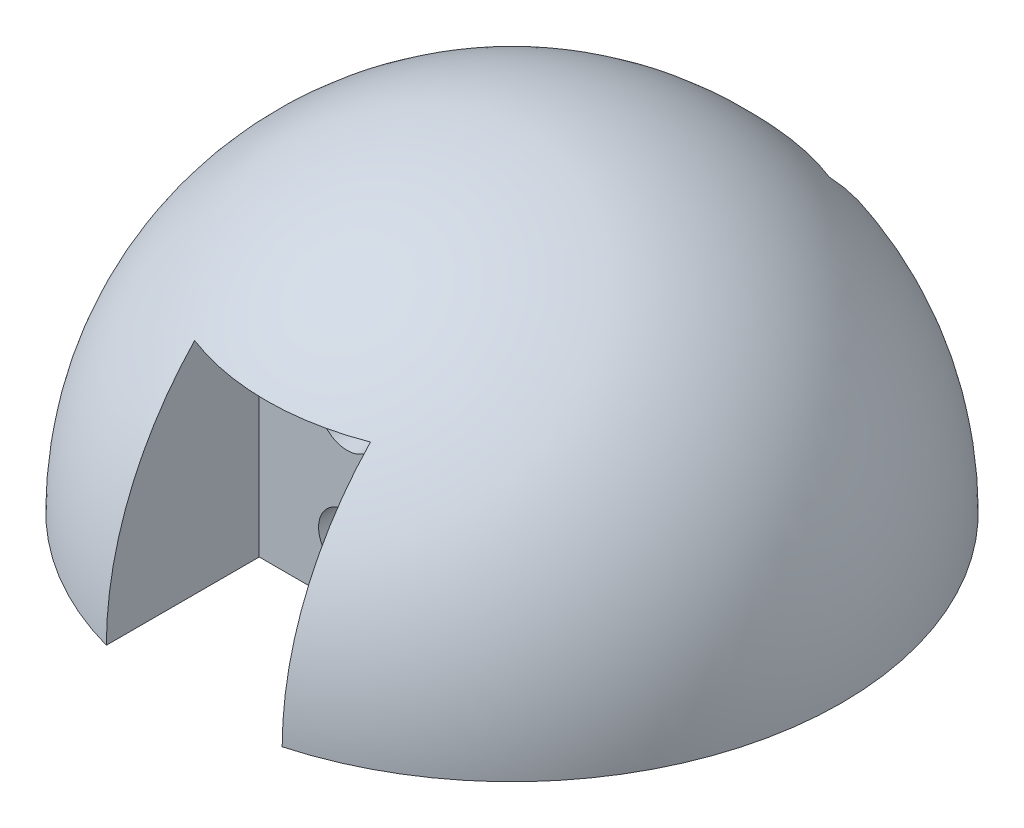
ISO-10303-21;
HEADER;
FILE_DESCRIPTION(('STEP AP214'),'2;1');
FILE_NAME('part.step','',(''),(''),'','','');
FILE_SCHEMA(('AUTOMOTIVE_DESIGN { 1 0 10303 214 1 1 1 1 }'));
ENDSEC;
DATA;
#1=APPLICATION_CONTEXT('core data for automotive mechanical design processes');
#2=APPLICATION_PROTOCOL_DEFINITION('international standard','automotive_design',2000,#1);
#3=PRODUCT_CONTEXT('',#1,'mechanical');
#4=PRODUCT('Part','Part','',(#3));
#5=PRODUCT_RELATED_PRODUCT_CATEGORY('part','',(#4));
#6=PRODUCT_DEFINITION_FORMATION('','',#4);
#7=PRODUCT_DEFINITION_CONTEXT('part definition',#1,'design');
#8=PRODUCT_DEFINITION('design','',#6,#7);
#9=PRODUCT_DEFINITION_SHAPE('','',#8);
#10=(LENGTH_UNIT() NAMED_UNIT(*) SI_UNIT(.MILLI.,.METRE.));
#11=(NAMED_UNIT(*) PLANE_ANGLE_UNIT() SI_UNIT($,.RADIAN.));
#12=(NAMED_UNIT(*) SI_UNIT($,.STERADIAN.) SOLID_ANGLE_UNIT());
#13=UNCERTAINTY_MEASURE_WITH_UNIT(LENGTH_MEASURE(1.E-05),#10,'distance_accuracy_value','');
#14=(GEOMETRIC_REPRESENTATION_CONTEXT(3) GLOBAL_UNCERTAINTY_ASSIGNED_CONTEXT((#13)) GLOBAL_UNIT_ASSIGNED_CONTEXT((#10,
#11,#12)) REPRESENTATION_CONTEXT('',''));
#15=CARTESIAN_POINT('',(0.,0.,0.));
#16=DIRECTION('',(0.,0.,1.));
#17=DIRECTION('',(1.,0.,0.));
#18=AXIS2_PLACEMENT_3D('',#15,#16,#17);
#19=CARTESIAN_POINT('',(0.,0.,0.));
#20=DIRECTION('',(0.,-1.,0.));
#21=DIRECTION('',(-1.,0.,0.));
#22=AXIS2_PLACEMENT_3D('',#19,#20,#21);
#23=SPHERICAL_SURFACE('',#22,30.);
#24=CARTESIAN_POINT('',(0.,0.,0.));
#25=DIRECTION('',(0.,-1.,0.));
#26=DIRECTION('',(0.,0.,-1.));
#27=AXIS2_PLACEMENT_3D('',#24,#25,#26);
#28=CIRCLE('',#27,30.);
#29=CARTESIAN_POINT('',(-8.,0.,28.9136645896019));
#30=VERTEX_POINT('',#29);
#31=CARTESIAN_POINT('',(-8.,0.,-28.9136645896019));
#32=VERTEX_POINT('',#31);
#33=EDGE_CURVE('E285',#30,#32,#28,.T.);
#34=ORIENTED_EDGE('',*,*,#33,.F.);
#35=CARTESIAN_POINT('',(-8.,0.,0.));
#36=DIRECTION('',(-1.,0.,0.));
#37=DIRECTION('',(0.,0.,1.));
#38=AXIS2_PLACEMENT_3D('',#35,#36,#37);
#39=CIRCLE('',#38,28.9136645896019);
#40=CARTESIAN_POINT('',(-8.,20.,20.8806130178211));
#41=VERTEX_POINT('',#40);
#42=EDGE_CURVE('E191',#30,#41,#39,.T.);
#43=ORIENTED_EDGE('',*,*,#42,.T.);
#44=CARTESIAN_POINT('',(0.,20.,0.));
#45=DIRECTION('',(0.,1.,0.));
#46=DIRECTION('',(0.,0.,1.));
#47=AXIS2_PLACEMENT_3D('',#44,#45,#46);
#48=CIRCLE('',#47,22.3606797749979);
#49=CARTESIAN_POINT('',(8.,20.,20.8806130178211));
#50=VERTEX_POINT('',#49);
#51=EDGE_CURVE('E13',#41,#50,#48,.T.);
#52=ORIENTED_EDGE('',*,*,#51,.T.);
#53=CARTESIAN_POINT('',(8.,0.,0.));
#54=DIRECTION('',(1.,0.,0.));
#55=DIRECTION('',(0.,0.,-1.));
#56=AXIS2_PLACEMENT_3D('',#53,#54,#55);
#57=CIRCLE('',#56,28.9136645896019);
#58=CARTESIAN_POINT('',(8.,0.,28.9136645896019));
#59=VERTEX_POINT('',#58);
#60=EDGE_CURVE('E187',#50,#59,#57,.T.);
#61=ORIENTED_EDGE('',*,*,#60,.T.);
#62=CARTESIAN_POINT('',(8.,0.,-28.9136645896019));
#63=VERTEX_POINT('',#62);
#64=EDGE_CURVE('E172',#63,#59,#28,.T.);
#65=ORIENTED_EDGE('',*,*,#64,.F.);
#66=CARTESIAN_POINT('',(8.,0.,0.));
#67=DIRECTION('',(-1.,0.,0.));
#68=DIRECTION('',(0.,0.,1.));
#69=AXIS2_PLACEMENT_3D('',#66,#67,#68);
#70=CIRCLE('',#69,28.9136645896019);
#71=CARTESIAN_POINT('',(8.,20.,-20.8806130178211));
#72=VERTEX_POINT('',#71);
#73=EDGE_CURVE('E228',#72,#63,#70,.T.);
#74=ORIENTED_EDGE('',*,*,#73,.F.);
#75=CARTESIAN_POINT('',(0.,20.,0.));
#76=DIRECTION('',(0.,-1.,0.));
#77=DIRECTION('',(0.,0.,-1.));
#78=AXIS2_PLACEMENT_3D('',#75,#76,#77);
#79=CIRCLE('',#78,22.3606797749979);
#80=CARTESIAN_POINT('',(-8.,20.,-20.8806130178211));
#81=VERTEX_POINT('',#80);
#82=EDGE_CURVE('E66',#81,#72,#79,.T.);
#83=ORIENTED_EDGE('',*,*,#82,.F.);
#84=CARTESIAN_POINT('',(-8.,0.,0.));
#85=DIRECTION('',(1.,0.,0.));
#86=DIRECTION('',(0.,0.,-1.));
#87=AXIS2_PLACEMENT_3D('',#84,#85,#86);
#88=CIRCLE('',#87,28.9136645896019);
#89=EDGE_CURVE('E231',#32,#81,#88,.T.);
#90=ORIENTED_EDGE('',*,*,#89,.F.);
#91=EDGE_LOOP('',(#34,#43,#52,#61,#65,#74,#83,#90));
#92=FACE_BOUND('',#91,.T.);
#93=ADVANCED_FACE('F58',(#92),#23,.T.);
#94=CARTESIAN_POINT('',(0.,0.,0.));
#95=DIRECTION('',(0.,-1.,0.));
#96=DIRECTION('',(0.,0.,-1.));
#97=AXIS2_PLACEMENT_3D('',#94,#95,#96);
#98=PLANE('',#97);
#99=DIRECTION('',(0.,0.,1.));
#100=VECTOR('',#99,1.);
#101=CARTESIAN_POINT('',(-8.,0.,15.));
#102=LINE('',#101,#100);
#103=CARTESIAN_POINT('',(-8.,0.,15.));
#104=VERTEX_POINT('',#103);
#105=EDGE_CURVE('E174',#104,#30,#102,.T.);
#106=ORIENTED_EDGE('',*,*,#105,.T.);
#107=ORIENTED_EDGE('',*,*,#33,.T.);
#108=DIRECTION('',(0.,0.,-1.));
#109=VECTOR('',#108,1.);
#110=CARTESIAN_POINT('',(-8.,0.,-15.));
#111=LINE('',#110,#109);
#112=CARTESIAN_POINT('',(-8.,0.,-15.));
#113=VERTEX_POINT('',#112);
#114=EDGE_CURVE('E219',#113,#32,#111,.T.);
#115=ORIENTED_EDGE('',*,*,#114,.F.);
#116=DIRECTION('',(1.,0.,0.));
#117=VECTOR('',#116,1.);
#118=CARTESIAN_POINT('',(-8.,0.,-15.));
#119=LINE('',#118,#117);
#120=CARTESIAN_POINT('',(8.,0.,-15.));
#121=VERTEX_POINT('',#120);
#122=EDGE_CURVE('E199',#113,#121,#119,.T.);
#123=ORIENTED_EDGE('',*,*,#122,.T.);
#124=DIRECTION('',(0.,0.,-1.));
#125=VECTOR('',#124,1.);
#126=CARTESIAN_POINT('',(8.,0.,-15.));
#127=LINE('',#126,#125);
#128=EDGE_CURVE('E216',#121,#63,#127,.T.);
#129=ORIENTED_EDGE('',*,*,#128,.T.);
#130=ORIENTED_EDGE('',*,*,#64,.T.);
#131=DIRECTION('',(0.,0.,1.));
#132=VECTOR('',#131,1.);
#133=CARTESIAN_POINT('',(8.,0.,15.));
#134=LINE('',#133,#132);
#135=CARTESIAN_POINT('',(8.,0.,15.));
#136=VERTEX_POINT('',#135);
#137=EDGE_CURVE('E151',#136,#59,#134,.T.);
#138=ORIENTED_EDGE('',*,*,#137,.F.);
#139=DIRECTION('',(1.,0.,0.));
#140=VECTOR('',#139,1.);
#141=CARTESIAN_POINT('',(-8.,0.,15.));
#142=LINE('',#141,#140);
#143=EDGE_CURVE('E158',#104,#136,#142,.T.);
#144=ORIENTED_EDGE('',*,*,#143,.F.);
#145=EDGE_LOOP('',(#106,#107,#115,#123,#129,#130,#138,#144));
#146=FACE_BOUND('',#145,.T.);
#147=DIRECTION('',(0.,0.,-1.));
#148=VECTOR('',#147,1.);
#149=CARTESIAN_POINT('',(-10.,0.,5.));
#150=LINE('',#149,#148);
#151=CARTESIAN_POINT('',(-10.,0.,5.));
#152=VERTEX_POINT('',#151);
#153=CARTESIAN_POINT('',(-10.,0.,-5.));
#154=VERTEX_POINT('',#153);
#155=EDGE_CURVE('E247',#152,#154,#150,.T.);
#156=ORIENTED_EDGE('',*,*,#155,.F.);
#157=DIRECTION('',(-1.,0.,0.));
#158=VECTOR('',#157,1.);
#159=CARTESIAN_POINT('',(-10.,0.,5.));
#160=LINE('',#159,#158);
#161=CARTESIAN_POINT('',(10.,0.,5.));
#162=VERTEX_POINT('',#161);
#163=EDGE_CURVE('E256',#162,#152,#160,.T.);
#164=ORIENTED_EDGE('',*,*,#163,.F.);
#165=DIRECTION('',(0.,0.,1.));
#166=VECTOR('',#165,1.);
#167=CARTESIAN_POINT('',(10.,0.,5.));
#168=LINE('',#167,#166);
#169=CARTESIAN_POINT('',(10.,0.,-5.));
#170=VERTEX_POINT('',#169);
#171=EDGE_CURVE('E275',#170,#162,#168,.T.);
#172=ORIENTED_EDGE('',*,*,#171,.F.);
#173=DIRECTION('',(1.,0.,0.));
#174=VECTOR('',#173,1.);
#175=CARTESIAN_POINT('',(-10.,0.,-5.));
#176=LINE('',#175,#174);
#177=EDGE_CURVE('E271',#154,#170,#176,.T.);
#178=ORIENTED_EDGE('',*,*,#177,.F.);
#179=EDGE_LOOP('',(#156,#164,#172,#178));
#180=FACE_BOUND('',#179,.T.);
#181=ADVANCED_FACE('F168',(#146,#180),#98,.T.);
#182=CARTESIAN_POINT('',(0.,5.,-30.));
#183=DIRECTION('',(0.,0.,1.));
#184=DIRECTION('',(1.,0.,0.));
#185=AXIS2_PLACEMENT_3D('',#182,#183,#184);
#186=CYLINDRICAL_SURFACE('',#185,2.6);
#187=CARTESIAN_POINT('',(0.,5.,-5.));
#188=DIRECTION('',(0.,0.,1.));
#189=DIRECTION('',(1.,0.,0.));
#190=AXIS2_PLACEMENT_3D('',#187,#188,#189);
#191=CIRCLE('',#190,2.6);
#192=CARTESIAN_POINT('',(2.6,5.,-5.));
#193=VERTEX_POINT('',#192);
#194=EDGE_CURVE('E234',#193,#193,#191,.T.);
#195=ORIENTED_EDGE('',*,*,#194,.T.);
#196=EDGE_LOOP('',(#195));
#197=FACE_BOUND('',#196,.T.);
#198=CARTESIAN_POINT('',(0.,5.,-15.));
#199=DIRECTION('',(0.,0.,-1.));
#200=DIRECTION('',(-1.,0.,0.));
#201=AXIS2_PLACEMENT_3D('',#198,#199,#200);
#202=CIRCLE('',#201,2.6);
#203=CARTESIAN_POINT('',(-2.6,5.,-15.));
#204=VERTEX_POINT('',#203);
#205=EDGE_CURVE('E224',#204,#204,#202,.F.);
#206=ORIENTED_EDGE('',*,*,#205,.F.);
#207=EDGE_LOOP('',(#206));
#208=FACE_BOUND('',#207,.T.);
#209=ADVANCED_FACE('F346',(#197,#208),#186,.F.);
#210=CARTESIAN_POINT('',(0.,15.,-30.));
#211=DIRECTION('',(0.,0.,1.));
#212=DIRECTION('',(1.,0.,0.));
#213=AXIS2_PLACEMENT_3D('',#210,#211,#212);
#214=CYLINDRICAL_SURFACE('',#213,2.6);
#215=CARTESIAN_POINT('',(0.,15.,-5.));
#216=DIRECTION('',(0.,0.,1.));
#217=DIRECTION('',(1.,0.,0.));
#218=AXIS2_PLACEMENT_3D('',#215,#216,#217);
#219=CIRCLE('',#218,2.6);
#220=CARTESIAN_POINT('',(2.6,15.,-5.));
#221=VERTEX_POINT('',#220);
#222=EDGE_CURVE('E235',#221,#221,#219,.T.);
#223=ORIENTED_EDGE('',*,*,#222,.T.);
#224=EDGE_LOOP('',(#223));
#225=FACE_BOUND('',#224,.T.);
#226=CARTESIAN_POINT('',(0.,15.,-15.));
#227=DIRECTION('',(0.,0.,-1.));
#228=DIRECTION('',(-1.,0.,0.));
#229=AXIS2_PLACEMENT_3D('',#226,#227,#228);
#230=CIRCLE('',#229,2.6);
#231=CARTESIAN_POINT('',(-2.6,15.,-15.));
#232=VERTEX_POINT('',#231);
#233=EDGE_CURVE('E223',#232,#232,#230,.F.);
#234=ORIENTED_EDGE('',*,*,#233,.F.);
#235=EDGE_LOOP('',(#234));
#236=FACE_BOUND('',#235,.T.);
#237=ADVANCED_FACE('F351',(#225,#236),#214,.F.);
#238=CARTESIAN_POINT('',(-10.,20.,5.));
#239=DIRECTION('',(-1.,0.,0.));
#240=DIRECTION('',(0.,0.,1.));
#241=AXIS2_PLACEMENT_3D('',#238,#239,#240);
#242=PLANE('',#241);
#243=ORIENTED_EDGE('',*,*,#155,.T.);
#244=DIRECTION('',(0.,-1.,0.));
#245=VECTOR('',#244,1.);
#246=CARTESIAN_POINT('',(-10.,20.,-5.));
#247=LINE('',#246,#245);
#248=CARTESIAN_POINT('',(-10.,20.,-5.));
#249=VERTEX_POINT('',#248);
#250=EDGE_CURVE('E268',#249,#154,#247,.T.);
#251=ORIENTED_EDGE('',*,*,#250,.F.);
#252=DIRECTION('',(0.,0.,-1.));
#253=VECTOR('',#252,1.);
#254=CARTESIAN_POINT('',(-10.,20.,5.));
#255=LINE('',#254,#253);
#256=CARTESIAN_POINT('',(-10.,20.,5.));
#257=VERTEX_POINT('',#256);
#258=EDGE_CURVE('E251',#257,#249,#255,.T.);
#259=ORIENTED_EDGE('',*,*,#258,.F.);
#260=DIRECTION('',(0.,-1.,0.));
#261=VECTOR('',#260,1.);
#262=CARTESIAN_POINT('',(-10.,20.,5.));
#263=LINE('',#262,#261);
#264=EDGE_CURVE('E282',#257,#152,#263,.T.);
#265=ORIENTED_EDGE('',*,*,#264,.T.);
#266=EDGE_LOOP('',(#243,#251,#259,#265));
#267=FACE_BOUND('',#266,.T.);
#268=ADVANCED_FACE('F355',(#267),#242,.F.);
#269=CARTESIAN_POINT('',(-10.,20.,5.));
#270=DIRECTION('',(0.,0.,1.));
#271=DIRECTION('',(1.,0.,0.));
#272=AXIS2_PLACEMENT_3D('',#269,#270,#271);
#273=PLANE('',#272);
#274=CARTESIAN_POINT('',(0.,15.,5.));
#275=DIRECTION('',(0.,0.,-1.));
#276=DIRECTION('',(-1.,0.,0.));
#277=AXIS2_PLACEMENT_3D('',#274,#275,#276);
#278=CIRCLE('',#277,2.6);
#279=CARTESIAN_POINT('',(-2.6,15.,5.));
#280=VERTEX_POINT('',#279);
#281=EDGE_CURVE('E243',#280,#280,#278,.T.);
#282=ORIENTED_EDGE('',*,*,#281,.F.);
#283=EDGE_LOOP('',(#282));
#284=FACE_BOUND('',#283,.T.);
#285=CARTESIAN_POINT('',(0.,5.0501256289338,5.));
#286=DIRECTION('',(0.,0.,-1.));
#287=DIRECTION('',(-1.,0.,0.));
#288=AXIS2_PLACEMENT_3D('',#285,#286,#287);
#289=CIRCLE('',#288,2.6);
#290=CARTESIAN_POINT('',(-2.6,5.0501256289338,5.));
#291=VERTEX_POINT('',#290);
#292=EDGE_CURVE('E239',#291,#291,#289,.T.);
#293=ORIENTED_EDGE('',*,*,#292,.F.);
#294=EDGE_LOOP('',(#293));
#295=FACE_BOUND('',#294,.T.);
#296=ORIENTED_EDGE('',*,*,#163,.T.);
#297=ORIENTED_EDGE('',*,*,#264,.F.);
#298=DIRECTION('',(-1.,0.,0.));
#299=VECTOR('',#298,1.);
#300=CARTESIAN_POINT('',(-10.,20.,5.));
#301=LINE('',#300,#299);
#302=CARTESIAN_POINT('',(10.,20.,5.));
#303=VERTEX_POINT('',#302);
#304=EDGE_CURVE('E264',#303,#257,#301,.T.);
#305=ORIENTED_EDGE('',*,*,#304,.F.);
#306=DIRECTION('',(0.,-1.,0.));
#307=VECTOR('',#306,1.);
#308=CARTESIAN_POINT('',(10.,20.,5.));
#309=LINE('',#308,#307);
#310=EDGE_CURVE('E286',#303,#162,#309,.T.);
#311=ORIENTED_EDGE('',*,*,#310,.T.);
#312=EDGE_LOOP('',(#296,#297,#305,#311));
#313=FACE_BOUND('',#312,.T.);
#314=ADVANCED_FACE('F358',(#284,#295,#313),#273,.F.);
#315=CARTESIAN_POINT('',(10.,20.,5.));
#316=DIRECTION('',(1.,0.,0.));
#317=DIRECTION('',(0.,0.,-1.));
#318=AXIS2_PLACEMENT_3D('',#315,#316,#317);
#319=PLANE('',#318);
#320=ORIENTED_EDGE('',*,*,#171,.T.);
#321=ORIENTED_EDGE('',*,*,#310,.F.);
#322=DIRECTION('',(0.,0.,1.));
#323=VECTOR('',#322,1.);
#324=CARTESIAN_POINT('',(10.,20.,5.));
#325=LINE('',#324,#323);
#326=CARTESIAN_POINT('',(10.,20.,-5.));
#327=VERTEX_POINT('',#326);
#328=EDGE_CURVE('E260',#327,#303,#325,.T.);
#329=ORIENTED_EDGE('',*,*,#328,.F.);
#330=DIRECTION('',(0.,-1.,0.));
#331=VECTOR('',#330,1.);
#332=CARTESIAN_POINT('',(10.,20.,-5.));
#333=LINE('',#332,#331);
#334=EDGE_CURVE('E289',#327,#170,#333,.T.);
#335=ORIENTED_EDGE('',*,*,#334,.T.);
#336=EDGE_LOOP('',(#320,#321,#329,#335));
#337=FACE_BOUND('',#336,.T.);
#338=ADVANCED_FACE('F364',(#337),#319,.F.);
#339=CARTESIAN_POINT('',(-10.,20.,-5.));
#340=DIRECTION('',(0.,0.,-1.));
#341=DIRECTION('',(-1.,0.,0.));
#342=AXIS2_PLACEMENT_3D('',#339,#340,#341);
#343=PLANE('',#342);
#344=ORIENTED_EDGE('',*,*,#222,.F.);
#345=EDGE_LOOP('',(#344));
#346=FACE_BOUND('',#345,.T.);
#347=ORIENTED_EDGE('',*,*,#194,.F.);
#348=EDGE_LOOP('',(#347));
#349=FACE_BOUND('',#348,.T.);
#350=ORIENTED_EDGE('',*,*,#177,.T.);
#351=ORIENTED_EDGE('',*,*,#334,.F.);
#352=DIRECTION('',(1.,0.,0.));
#353=VECTOR('',#352,1.);
#354=CARTESIAN_POINT('',(-10.,20.,-5.));
#355=LINE('',#354,#353);
#356=EDGE_CURVE('E255',#249,#327,#355,.T.);
#357=ORIENTED_EDGE('',*,*,#356,.F.);
#358=ORIENTED_EDGE('',*,*,#250,.T.);
#359=EDGE_LOOP('',(#350,#351,#357,#358));
#360=FACE_BOUND('',#359,.T.);
#361=ADVANCED_FACE('F360',(#346,#349,#360),#343,.F.);
#362=CARTESIAN_POINT('',(0.,20.,0.));
#363=DIRECTION('',(0.,-1.,0.));
#364=DIRECTION('',(0.,0.,-1.));
#365=AXIS2_PLACEMENT_3D('',#362,#363,#364);
#366=PLANE('',#365);
#367=ORIENTED_EDGE('',*,*,#258,.T.);
#368=ORIENTED_EDGE('',*,*,#356,.T.);
#369=ORIENTED_EDGE('',*,*,#328,.T.);
#370=ORIENTED_EDGE('',*,*,#304,.T.);
#371=EDGE_LOOP('',(#367,#368,#369,#370));
#372=FACE_BOUND('',#371,.T.);
#373=ADVANCED_FACE('F363',(#372),#366,.T.);
#374=CARTESIAN_POINT('',(0.,5.0501256289338,30.));
#375=DIRECTION('',(0.,0.,-1.));
#376=DIRECTION('',(-1.,0.,0.));
#377=AXIS2_PLACEMENT_3D('',#374,#375,#376);
#378=CYLINDRICAL_SURFACE('',#377,2.6);
#379=CARTESIAN_POINT('',(0.,5.0501256289338,15.));
#380=DIRECTION('',(0.,0.,-1.));
#381=DIRECTION('',(-1.,0.,0.));
#382=AXIS2_PLACEMENT_3D('',#379,#380,#381);
#383=CIRCLE('',#382,2.6);
#384=CARTESIAN_POINT('',(-2.6,5.0501256289338,15.));
#385=VERTEX_POINT('',#384);
#386=EDGE_CURVE('E183',#385,#385,#383,.F.);
#387=ORIENTED_EDGE('',*,*,#386,.T.);
#388=EDGE_LOOP('',(#387));
#389=FACE_BOUND('',#388,.T.);
#390=ORIENTED_EDGE('',*,*,#292,.T.);
#391=EDGE_LOOP('',(#390));
#392=FACE_BOUND('',#391,.T.);
#393=ADVANCED_FACE('F374',(#389,#392),#378,.F.);
#394=CARTESIAN_POINT('',(0.,15.,30.));
#395=DIRECTION('',(0.,0.,-1.));
#396=DIRECTION('',(-1.,0.,0.));
#397=AXIS2_PLACEMENT_3D('',#394,#395,#396);
#398=CYLINDRICAL_SURFACE('',#397,2.6);
#399=CARTESIAN_POINT('',(0.,15.,15.));
#400=DIRECTION('',(0.,0.,-1.));
#401=DIRECTION('',(-1.,0.,0.));
#402=AXIS2_PLACEMENT_3D('',#399,#400,#401);
#403=CIRCLE('',#402,2.6);
#404=CARTESIAN_POINT('',(-2.6,15.,15.));
#405=VERTEX_POINT('',#404);
#406=EDGE_CURVE('E188',#405,#405,#403,.F.);
#407=ORIENTED_EDGE('',*,*,#406,.T.);
#408=EDGE_LOOP('',(#407));
#409=FACE_BOUND('',#408,.T.);
#410=ORIENTED_EDGE('',*,*,#281,.T.);
#411=EDGE_LOOP('',(#410));
#412=FACE_BOUND('',#411,.T.);
#413=ADVANCED_FACE('F377',(#409,#412),#398,.F.);
#414=CARTESIAN_POINT('',(-8.,20.,-15.));
#415=DIRECTION('',(0.,-1.,0.));
#416=DIRECTION('',(0.,0.,-1.));
#417=AXIS2_PLACEMENT_3D('',#414,#415,#416);
#418=PLANE('',#417);
#419=ORIENTED_EDGE('',*,*,#82,.T.);
#420=DIRECTION('',(0.,0.,-1.));
#421=VECTOR('',#420,1.);
#422=CARTESIAN_POINT('',(8.,20.,-15.));
#423=LINE('',#422,#421);
#424=CARTESIAN_POINT('',(8.,20.,-15.));
#425=VERTEX_POINT('',#424);
#426=EDGE_CURVE('E212',#425,#72,#423,.T.);
#427=ORIENTED_EDGE('',*,*,#426,.F.);
#428=DIRECTION('',(-1.,0.,0.));
#429=VECTOR('',#428,1.);
#430=CARTESIAN_POINT('',(-8.,20.,-15.));
#431=LINE('',#430,#429);
#432=CARTESIAN_POINT('',(-8.,20.,-15.));
#433=VERTEX_POINT('',#432);
#434=EDGE_CURVE('E205',#425,#433,#431,.T.);
#435=ORIENTED_EDGE('',*,*,#434,.T.);
#436=DIRECTION('',(0.,0.,-1.));
#437=VECTOR('',#436,1.);
#438=CARTESIAN_POINT('',(-8.,20.,-15.));
#439=LINE('',#438,#437);
#440=EDGE_CURVE('E208',#433,#81,#439,.T.);
#441=ORIENTED_EDGE('',*,*,#440,.T.);
#442=EDGE_LOOP('',(#419,#427,#435,#441));
#443=FACE_BOUND('',#442,.T.);
#444=ADVANCED_FACE('F327',(#443),#418,.T.);
#445=CARTESIAN_POINT('',(-8.,0.,-15.));
#446=DIRECTION('',(1.,0.,0.));
#447=DIRECTION('',(0.,0.,-1.));
#448=AXIS2_PLACEMENT_3D('',#445,#446,#447);
#449=PLANE('',#448);
#450=ORIENTED_EDGE('',*,*,#89,.T.);
#451=ORIENTED_EDGE('',*,*,#440,.F.);
#452=DIRECTION('',(0.,-1.,0.));
#453=VECTOR('',#452,1.);
#454=CARTESIAN_POINT('',(-8.,0.,-15.));
#455=LINE('',#454,#453);
#456=EDGE_CURVE('E195',#433,#113,#455,.T.);
#457=ORIENTED_EDGE('',*,*,#456,.T.);
#458=ORIENTED_EDGE('',*,*,#114,.T.);
#459=EDGE_LOOP('',(#450,#451,#457,#458));
#460=FACE_BOUND('',#459,.T.);
#461=ADVANCED_FACE('F324',(#460),#449,.T.);
#462=CARTESIAN_POINT('',(8.,0.,-15.));
#463=DIRECTION('',(-1.,0.,0.));
#464=DIRECTION('',(0.,0.,1.));
#465=AXIS2_PLACEMENT_3D('',#462,#463,#464);
#466=PLANE('',#465);
#467=ORIENTED_EDGE('',*,*,#73,.T.);
#468=ORIENTED_EDGE('',*,*,#128,.F.);
#469=DIRECTION('',(0.,1.,0.));
#470=VECTOR('',#469,1.);
#471=CARTESIAN_POINT('',(8.,0.,-15.));
#472=LINE('',#471,#470);
#473=EDGE_CURVE('E81',#121,#425,#472,.T.);
#474=ORIENTED_EDGE('',*,*,#473,.T.);
#475=ORIENTED_EDGE('',*,*,#426,.T.);
#476=EDGE_LOOP('',(#467,#468,#474,#475));
#477=FACE_BOUND('',#476,.T.);
#478=ADVANCED_FACE('F332',(#477),#466,.T.);
#479=CARTESIAN_POINT('',(0.,0.,-15.));
#480=DIRECTION('',(0.,0.,-1.));
#481=DIRECTION('',(-1.,0.,0.));
#482=AXIS2_PLACEMENT_3D('',#479,#480,#481);
#483=PLANE('',#482);
#484=ORIENTED_EDGE('',*,*,#456,.F.);
#485=ORIENTED_EDGE('',*,*,#434,.F.);
#486=ORIENTED_EDGE('',*,*,#473,.F.);
#487=ORIENTED_EDGE('',*,*,#122,.F.);
#488=EDGE_LOOP('',(#484,#485,#486,#487));
#489=FACE_BOUND('',#488,.T.);
#490=ORIENTED_EDGE('',*,*,#233,.T.);
#491=EDGE_LOOP('',(#490));
#492=FACE_BOUND('',#491,.T.);
#493=ORIENTED_EDGE('',*,*,#205,.T.);
#494=EDGE_LOOP('',(#493));
#495=FACE_BOUND('',#494,.T.);
#496=ADVANCED_FACE('F329',(#489,#492,#495),#483,.T.);
#497=CARTESIAN_POINT('',(-8.,20.,15.));
#498=DIRECTION('',(0.,1.,0.));
#499=DIRECTION('',(0.,0.,1.));
#500=AXIS2_PLACEMENT_3D('',#497,#498,#499);
#501=PLANE('',#500);
#502=DIRECTION('',(0.,0.,1.));
#503=VECTOR('',#502,1.);
#504=CARTESIAN_POINT('',(-8.,20.,15.));
#505=LINE('',#504,#503);
#506=CARTESIAN_POINT('',(-8.,20.,15.));
#507=VERTEX_POINT('',#506);
#508=EDGE_CURVE('E178',#507,#41,#505,.T.);
#509=ORIENTED_EDGE('',*,*,#508,.F.);
#510=DIRECTION('',(-1.,0.,0.));
#511=VECTOR('',#510,1.);
#512=CARTESIAN_POINT('',(-8.,20.,15.));
#513=LINE('',#512,#511);
#514=CARTESIAN_POINT('',(8.,20.,15.));
#515=VERTEX_POINT('',#514);
#516=EDGE_CURVE('E157',#515,#507,#513,.T.);
#517=ORIENTED_EDGE('',*,*,#516,.F.);
#518=DIRECTION('',(0.,0.,1.));
#519=VECTOR('',#518,1.);
#520=CARTESIAN_POINT('',(8.,20.,15.));
#521=LINE('',#520,#519);
#522=EDGE_CURVE('E154',#515,#50,#521,.T.);
#523=ORIENTED_EDGE('',*,*,#522,.T.);
#524=ORIENTED_EDGE('',*,*,#51,.F.);
#525=EDGE_LOOP('',(#509,#517,#523,#524));
#526=FACE_BOUND('',#525,.T.);
#527=ADVANCED_FACE('F313',(#526),#501,.F.);
#528=CARTESIAN_POINT('',(-8.,0.,15.));
#529=DIRECTION('',(-1.,0.,0.));
#530=DIRECTION('',(0.,0.,1.));
#531=AXIS2_PLACEMENT_3D('',#528,#529,#530);
#532=PLANE('',#531);
#533=ORIENTED_EDGE('',*,*,#105,.F.);
#534=DIRECTION('',(0.,-1.,0.));
#535=VECTOR('',#534,1.);
#536=CARTESIAN_POINT('',(-8.,0.,15.));
#537=LINE('',#536,#535);
#538=EDGE_CURVE('E73',#507,#104,#537,.T.);
#539=ORIENTED_EDGE('',*,*,#538,.F.);
#540=ORIENTED_EDGE('',*,*,#508,.T.);
#541=ORIENTED_EDGE('',*,*,#42,.F.);
#542=EDGE_LOOP('',(#533,#539,#540,#541));
#543=FACE_BOUND('',#542,.T.);
#544=ADVANCED_FACE('F314',(#543),#532,.F.);
#545=CARTESIAN_POINT('',(8.,0.,15.));
#546=DIRECTION('',(1.,0.,0.));
#547=DIRECTION('',(0.,0.,-1.));
#548=AXIS2_PLACEMENT_3D('',#545,#546,#547);
#549=PLANE('',#548);
#550=ORIENTED_EDGE('',*,*,#522,.F.);
#551=DIRECTION('',(0.,1.,0.));
#552=VECTOR('',#551,1.);
#553=CARTESIAN_POINT('',(8.,0.,15.));
#554=LINE('',#553,#552);
#555=EDGE_CURVE('E148',#136,#515,#554,.T.);
#556=ORIENTED_EDGE('',*,*,#555,.F.);
#557=ORIENTED_EDGE('',*,*,#137,.T.);
#558=ORIENTED_EDGE('',*,*,#60,.F.);
#559=EDGE_LOOP('',(#550,#556,#557,#558));
#560=FACE_BOUND('',#559,.T.);
#561=ADVANCED_FACE('F149',(#560),#549,.F.);
#562=CARTESIAN_POINT('',(0.,0.,15.));
#563=DIRECTION('',(0.,0.,-1.));
#564=DIRECTION('',(-1.,0.,0.));
#565=AXIS2_PLACEMENT_3D('',#562,#563,#564);
#566=PLANE('',#565);
#567=ORIENTED_EDGE('',*,*,#406,.F.);
#568=EDGE_LOOP('',(#567));
#569=FACE_BOUND('',#568,.T.);
#570=ORIENTED_EDGE('',*,*,#538,.T.);
#571=ORIENTED_EDGE('',*,*,#143,.T.);
#572=ORIENTED_EDGE('',*,*,#555,.T.);
#573=ORIENTED_EDGE('',*,*,#516,.T.);
#574=EDGE_LOOP('',(#570,#571,#572,#573));
#575=FACE_BOUND('',#574,.T.);
#576=ORIENTED_EDGE('',*,*,#386,.F.);
#577=EDGE_LOOP('',(#576));
#578=FACE_BOUND('',#577,.T.);
#579=ADVANCED_FACE('F161',(#569,#575,#578),#566,.F.);
#580=CLOSED_SHELL('',(#93,#181,#209,#237,#268,#314,#338,#361,#373,#393,#413,#444,#461,#478,#496,
#527,#544,#561,#579));
#581=MANIFOLD_SOLID_BREP('B2',#580);
#582=ADVANCED_BREP_SHAPE_REPRESENTATION('',(#18,#581),#14);
#583=SHAPE_DEFINITION_REPRESENTATION(#9,#582);
ENDSEC;
END-ISO-10303-21;
